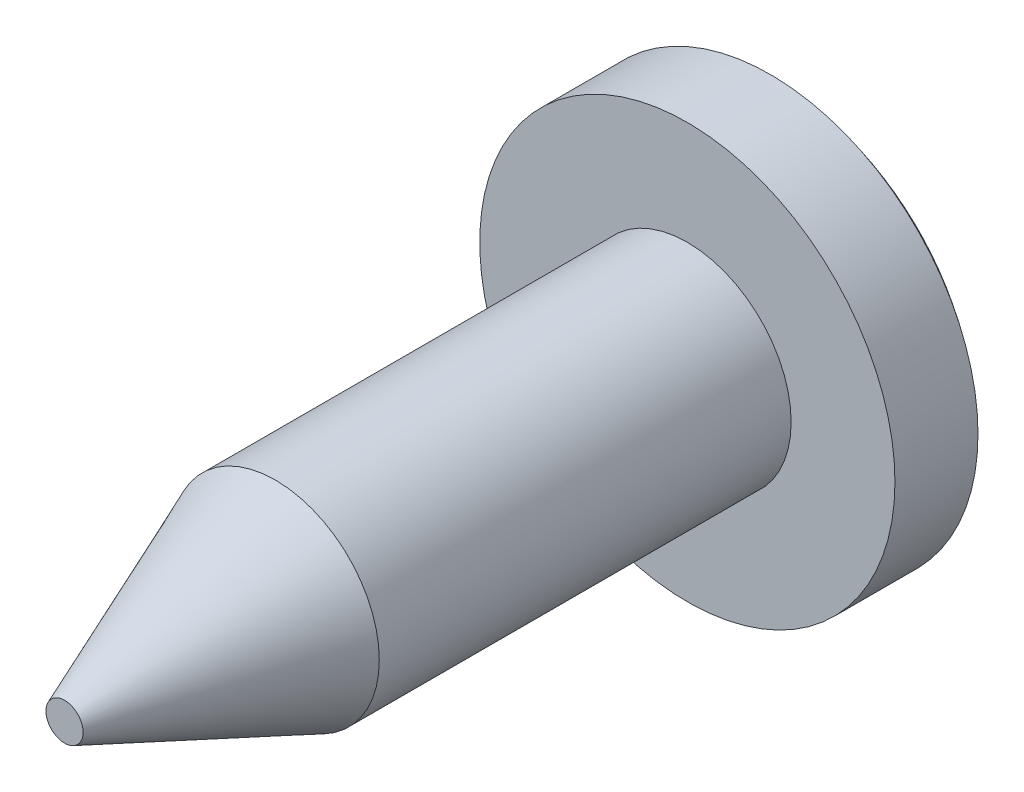
ISO-10303-21;
HEADER;
FILE_DESCRIPTION(('STEP AP214'),'2;1');
FILE_NAME('part.step','',(''),(''),'','','');
FILE_SCHEMA(('AUTOMOTIVE_DESIGN { 1 0 10303 214 1 1 1 1 }'));
ENDSEC;
DATA;
#1=APPLICATION_CONTEXT('core data for automotive mechanical design processes');
#2=APPLICATION_PROTOCOL_DEFINITION('international standard','automotive_design',2000,#1);
#3=PRODUCT_CONTEXT('',#1,'mechanical');
#4=PRODUCT('Part','Part','',(#3));
#5=PRODUCT_RELATED_PRODUCT_CATEGORY('part','',(#4));
#6=PRODUCT_DEFINITION_FORMATION('','',#4);
#7=PRODUCT_DEFINITION_CONTEXT('part definition',#1,'design');
#8=PRODUCT_DEFINITION('design','',#6,#7);
#9=PRODUCT_DEFINITION_SHAPE('','',#8);
#10=(LENGTH_UNIT() NAMED_UNIT(*) SI_UNIT(.MILLI.,.METRE.));
#11=(NAMED_UNIT(*) PLANE_ANGLE_UNIT() SI_UNIT($,.RADIAN.));
#12=(NAMED_UNIT(*) SI_UNIT($,.STERADIAN.) SOLID_ANGLE_UNIT());
#13=UNCERTAINTY_MEASURE_WITH_UNIT(LENGTH_MEASURE(1.E-05),#10,'distance_accuracy_value','');
#14=(GEOMETRIC_REPRESENTATION_CONTEXT(3) GLOBAL_UNCERTAINTY_ASSIGNED_CONTEXT((#13)) GLOBAL_UNIT_ASSIGNED_CONTEXT((#10,
#11,#12)) REPRESENTATION_CONTEXT('',''));
#15=CARTESIAN_POINT('',(0.,0.,0.));
#16=DIRECTION('',(0.,0.,1.));
#17=DIRECTION('',(1.,0.,0.));
#18=AXIS2_PLACEMENT_3D('',#15,#16,#17);
#19=CARTESIAN_POINT('',(0.3,-1.27,-6.8));
#20=DIRECTION('',(1.,0.,0.));
#21=DIRECTION('',(0.,0.,-1.));
#22=AXIS2_PLACEMENT_3D('',#19,#20,#21);
#23=PLANE('',#22);
#24=CARTESIAN_POINT('',(0.3,0.,-4.29285714285715));
#25=DIRECTION('',(1.,0.,0.));
#26=DIRECTION('',(0.,0.,-1.));
#27=AXIS2_PLACEMENT_3D('',#24,#25,#26);
#28=CIRCLE('',#27,3.19308084866675);
#29=CARTESIAN_POINT('',(0.3,1.27,-7.22250990489609));
#30=VERTEX_POINT('',#29);
#31=CARTESIAN_POINT('',(0.3,0.294469512293891,-7.47233084340128));
#32=VERTEX_POINT('',#31);
#33=EDGE_CURVE('E209',#30,#32,#28,.F.);
#34=ORIENTED_EDGE('',*,*,#33,.T.);
#35=DIRECTION('',(0.,0.,1.));
#36=VECTOR('',#35,1.);
#37=CARTESIAN_POINT('',(0.3,0.294469512293891,-6.8));
#38=LINE('',#37,#36);
#39=CARTESIAN_POINT('',(0.3,0.294469512293891,-6.8));
#40=VERTEX_POINT('',#39);
#41=EDGE_CURVE('E166',#32,#40,#38,.T.);
#42=ORIENTED_EDGE('',*,*,#41,.T.);
#43=DIRECTION('',(0.,1.,0.));
#44=VECTOR('',#43,1.);
#45=CARTESIAN_POINT('',(0.3,-1.27,-6.8));
#46=LINE('',#45,#44);
#47=CARTESIAN_POINT('',(0.3,1.27,-6.8));
#48=VERTEX_POINT('',#47);
#49=EDGE_CURVE('E192',#40,#48,#46,.T.);
#50=ORIENTED_EDGE('',*,*,#49,.T.);
#51=DIRECTION('',(0.,0.,-1.));
#52=VECTOR('',#51,1.);
#53=CARTESIAN_POINT('',(0.3,1.27,-6.8));
#54=LINE('',#53,#52);
#55=EDGE_CURVE('E180',#48,#30,#54,.T.);
#56=ORIENTED_EDGE('',*,*,#55,.T.);
#57=EDGE_LOOP('',(#34,#42,#50,#56));
#58=FACE_BOUND('',#57,.T.);
#59=ADVANCED_FACE('F36',(#58),#23,.F.);
#60=CARTESIAN_POINT('',(-0.3,-1.27,-6.8));
#61=DIRECTION('',(-1.,0.,0.));
#62=DIRECTION('',(0.,0.,1.));
#63=AXIS2_PLACEMENT_3D('',#60,#61,#62);
#64=PLANE('',#63);
#65=DIRECTION('',(0.,1.,0.));
#66=VECTOR('',#65,1.);
#67=CARTESIAN_POINT('',(-0.3,-1.27,-6.8));
#68=LINE('',#67,#66);
#69=CARTESIAN_POINT('',(-0.3,0.294469512293891,-6.8));
#70=VERTEX_POINT('',#69);
#71=CARTESIAN_POINT('',(-0.3,1.27,-6.8));
#72=VERTEX_POINT('',#71);
#73=EDGE_CURVE('E179',#70,#72,#68,.T.);
#74=ORIENTED_EDGE('',*,*,#73,.F.);
#75=DIRECTION('',(0.,0.,-1.));
#76=VECTOR('',#75,1.);
#77=CARTESIAN_POINT('',(-0.3,0.294469512293891,-6.8));
#78=LINE('',#77,#76);
#79=CARTESIAN_POINT('',(-0.3,0.294469512293891,-7.47233084340128));
#80=VERTEX_POINT('',#79);
#81=EDGE_CURVE('E217',#70,#80,#78,.T.);
#82=ORIENTED_EDGE('',*,*,#81,.T.);
#83=CARTESIAN_POINT('',(-0.3,0.,-4.29285714285715));
#84=DIRECTION('',(-1.,0.,0.));
#85=DIRECTION('',(0.,0.,1.));
#86=AXIS2_PLACEMENT_3D('',#83,#84,#85);
#87=CIRCLE('',#86,3.19308084866675);
#88=CARTESIAN_POINT('',(-0.3,1.27,-7.22250990489609));
#89=VERTEX_POINT('',#88);
#90=EDGE_CURVE('E204',#80,#89,#87,.F.);
#91=ORIENTED_EDGE('',*,*,#90,.T.);
#92=DIRECTION('',(0.,0.,1.));
#93=VECTOR('',#92,1.);
#94=CARTESIAN_POINT('',(-0.3,1.27,-6.8));
#95=LINE('',#94,#93);
#96=EDGE_CURVE('E183',#89,#72,#95,.T.);
#97=ORIENTED_EDGE('',*,*,#96,.T.);
#98=EDGE_LOOP('',(#74,#82,#91,#97));
#99=FACE_BOUND('',#98,.T.);
#100=ADVANCED_FACE('F239',(#99),#64,.F.);
#101=CARTESIAN_POINT('',(0.,0.,-4.29285714285715));
#102=DIRECTION('',(0.,0.,1.));
#103=DIRECTION('',(1.,0.,0.));
#104=AXIS2_PLACEMENT_3D('',#101,#102,#103);
#105=SPHERICAL_SURFACE('',#104,3.20714285714285);
#106=CARTESIAN_POINT('',(0.,0.294469512293891,-4.29285714285715));
#107=DIRECTION('',(0.,1.,0.));
#108=DIRECTION('',(0.,0.,1.));
#109=AXIS2_PLACEMENT_3D('',#106,#107,#108);
#110=CIRCLE('',#109,3.19359562444148);
#111=CARTESIAN_POINT('',(-1.27,0.294469512293891,-7.22307095970598));
#112=VERTEX_POINT('',#111);
#113=EDGE_CURVE('E164',#112,#80,#110,.F.);
#114=ORIENTED_EDGE('',*,*,#113,.F.);
#115=CARTESIAN_POINT('',(-1.27,0.,-4.29285714285715));
#116=DIRECTION('',(1.,0.,0.));
#117=DIRECTION('',(0.,0.,-1.));
#118=AXIS2_PLACEMENT_3D('',#115,#116,#117);
#119=CIRCLE('',#118,2.94497288716253);
#120=CARTESIAN_POINT('',(-1.27,-0.294469512293891,-7.22307095970598));
#121=VERTEX_POINT('',#120);
#122=EDGE_CURVE('E222',#112,#121,#119,.F.);
#123=ORIENTED_EDGE('',*,*,#122,.T.);
#124=CARTESIAN_POINT('',(0.,-0.294469512293891,-4.29285714285715));
#125=DIRECTION('',(0.,-1.,0.));
#126=DIRECTION('',(0.,0.,-1.));
#127=AXIS2_PLACEMENT_3D('',#124,#125,#126);
#128=CIRCLE('',#127,3.19359562444148);
#129=CARTESIAN_POINT('',(-0.3,-0.294469512293891,-7.47233084340128));
#130=VERTEX_POINT('',#129);
#131=EDGE_CURVE('E140',#130,#121,#128,.F.);
#132=ORIENTED_EDGE('',*,*,#131,.F.);
#133=CARTESIAN_POINT('',(-0.3,-1.27,-7.22250990489609));
#134=VERTEX_POINT('',#133);
#135=EDGE_CURVE('E205',#134,#130,#87,.F.);
#136=ORIENTED_EDGE('',*,*,#135,.F.);
#137=CARTESIAN_POINT('',(0.,-1.27,-4.29285714285715));
#138=DIRECTION('',(0.,1.,0.));
#139=DIRECTION('',(0.,0.,1.));
#140=AXIS2_PLACEMENT_3D('',#137,#138,#139);
#141=CIRCLE('',#140,2.94497288716253);
#142=CARTESIAN_POINT('',(0.3,-1.27,-7.22250990489609));
#143=VERTEX_POINT('',#142);
#144=EDGE_CURVE('E212',#134,#143,#141,.F.);
#145=ORIENTED_EDGE('',*,*,#144,.T.);
#146=CARTESIAN_POINT('',(0.3,-0.294469512293891,-7.47233084340128));
#147=VERTEX_POINT('',#146);
#148=EDGE_CURVE('E208',#147,#143,#28,.F.);
#149=ORIENTED_EDGE('',*,*,#148,.F.);
#150=CARTESIAN_POINT('',(1.27,-0.294469512293891,-7.22307095970598));
#151=VERTEX_POINT('',#150);
#152=EDGE_CURVE('E51',#151,#147,#128,.F.);
#153=ORIENTED_EDGE('',*,*,#152,.F.);
#154=CARTESIAN_POINT('',(1.27,0.,-4.29285714285715));
#155=DIRECTION('',(1.,0.,0.));
#156=DIRECTION('',(0.,0.,-1.));
#157=AXIS2_PLACEMENT_3D('',#154,#155,#156);
#158=CIRCLE('',#157,2.94497288716253);
#159=CARTESIAN_POINT('',(1.27,0.294469512293891,-7.22307095970598));
#160=VERTEX_POINT('',#159);
#161=EDGE_CURVE('E220',#160,#151,#158,.F.);
#162=ORIENTED_EDGE('',*,*,#161,.F.);
#163=EDGE_CURVE('E167',#32,#160,#110,.F.);
#164=ORIENTED_EDGE('',*,*,#163,.F.);
#165=ORIENTED_EDGE('',*,*,#33,.F.);
#166=CARTESIAN_POINT('',(0.,1.27,-4.29285714285715));
#167=DIRECTION('',(0.,1.,0.));
#168=DIRECTION('',(0.,0.,1.));
#169=AXIS2_PLACEMENT_3D('',#166,#167,#168);
#170=CIRCLE('',#169,2.94497288716253);
#171=EDGE_CURVE('E202',#89,#30,#170,.F.);
#172=ORIENTED_EDGE('',*,*,#171,.F.);
#173=ORIENTED_EDGE('',*,*,#90,.F.);
#174=EDGE_LOOP('',(#114,#123,#132,#136,#145,#149,#153,#162,#164,#165,#172,#173));
#175=FACE_BOUND('',#174,.T.);
#176=CARTESIAN_POINT('',(0.,0.,-6.8));
#177=DIRECTION('',(0.,0.,1.));
#178=DIRECTION('',(1.,0.,0.));
#179=AXIS2_PLACEMENT_3D('',#176,#177,#178);
#180=CIRCLE('',#179,2.);
#181=CARTESIAN_POINT('',(2.,0.,-6.8));
#182=VERTEX_POINT('',#181);
#183=EDGE_CURVE('E191',#182,#182,#180,.T.);
#184=ORIENTED_EDGE('',*,*,#183,.F.);
#185=EDGE_LOOP('',(#184));
#186=FACE_BOUND('',#185,.T.);
#187=ADVANCED_FACE('F246',(#175,#186),#105,.T.);
#188=CARTESIAN_POINT('',(0.,0.,0.));
#189=DIRECTION('',(0.,0.,1.));
#190=DIRECTION('',(1.,0.,0.));
#191=AXIS2_PLACEMENT_3D('',#188,#189,#190);
#192=PLANE('',#191);
#193=CARTESIAN_POINT('',(0.,0.,0.));
#194=DIRECTION('',(0.,0.,1.));
#195=DIRECTION('',(1.,0.,0.));
#196=AXIS2_PLACEMENT_3D('',#193,#194,#195);
#197=CIRCLE('',#196,0.17901870910296);
#198=CARTESIAN_POINT('',(0.17901870910296,0.,0.));
#199=VERTEX_POINT('',#198);
#200=EDGE_CURVE('E44',#199,#199,#197,.T.);
#201=ORIENTED_EDGE('',*,*,#200,.T.);
#202=EDGE_LOOP('',(#201));
#203=FACE_BOUND('',#202,.T.);
#204=ADVANCED_FACE('F226',(#203),#192,.T.);
#205=CARTESIAN_POINT('',(0.,0.,0.));
#206=DIRECTION('',(0.,0.,1.));
#207=DIRECTION('',(1.,0.,0.));
#208=AXIS2_PLACEMENT_3D('',#205,#206,#207);
#209=CYLINDRICAL_SURFACE('',#208,1.);
#210=CARTESIAN_POINT('',(0.,0.,-2.03200000000002));
#211=DIRECTION('',(0.,0.,1.));
#212=DIRECTION('',(1.,0.,0.));
#213=AXIS2_PLACEMENT_3D('',#210,#211,#212);
#214=CIRCLE('',#213,1.);
#215=CARTESIAN_POINT('',(1.,0.,-2.03200000000002));
#216=VERTEX_POINT('',#215);
#217=EDGE_CURVE('E11',#216,#216,#214,.F.);
#218=ORIENTED_EDGE('',*,*,#217,.T.);
#219=EDGE_LOOP('',(#218));
#220=FACE_BOUND('',#219,.T.);
#221=CARTESIAN_POINT('',(0.,0.,-6.));
#222=DIRECTION('',(0.,0.,1.));
#223=DIRECTION('',(1.,0.,0.));
#224=AXIS2_PLACEMENT_3D('',#221,#222,#223);
#225=CIRCLE('',#224,1.);
#226=CARTESIAN_POINT('',(1.,0.,-6.));
#227=VERTEX_POINT('',#226);
#228=EDGE_CURVE('E199',#227,#227,#225,.T.);
#229=ORIENTED_EDGE('',*,*,#228,.T.);
#230=EDGE_LOOP('',(#229));
#231=FACE_BOUND('',#230,.T.);
#232=ADVANCED_FACE('F394',(#220,#231),#209,.T.);
#233=CARTESIAN_POINT('',(1.,0.,-6.));
#234=DIRECTION('',(0.,0.,1.));
#235=DIRECTION('',(1.,0.,0.));
#236=AXIS2_PLACEMENT_3D('',#233,#234,#235);
#237=PLANE('',#236);
#238=CARTESIAN_POINT('',(0.,0.,-6.));
#239=DIRECTION('',(0.,0.,1.));
#240=DIRECTION('',(1.,0.,0.));
#241=AXIS2_PLACEMENT_3D('',#238,#239,#240);
#242=CIRCLE('',#241,2.);
#243=CARTESIAN_POINT('',(2.,0.,-6.));
#244=VERTEX_POINT('',#243);
#245=EDGE_CURVE('E196',#244,#244,#242,.T.);
#246=ORIENTED_EDGE('',*,*,#245,.T.);
#247=EDGE_LOOP('',(#246));
#248=FACE_BOUND('',#247,.T.);
#249=ORIENTED_EDGE('',*,*,#228,.F.);
#250=EDGE_LOOP('',(#249));
#251=FACE_BOUND('',#250,.T.);
#252=ADVANCED_FACE('F259',(#248,#251),#237,.T.);
#253=CARTESIAN_POINT('',(0.,0.,0.));
#254=DIRECTION('',(0.,0.,1.));
#255=DIRECTION('',(1.,0.,0.));
#256=AXIS2_PLACEMENT_3D('',#253,#254,#255);
#257=CYLINDRICAL_SURFACE('',#256,2.);
#258=ORIENTED_EDGE('',*,*,#183,.T.);
#259=EDGE_LOOP('',(#258));
#260=FACE_BOUND('',#259,.T.);
#261=ORIENTED_EDGE('',*,*,#245,.F.);
#262=EDGE_LOOP('',(#261));
#263=FACE_BOUND('',#262,.T.);
#264=ADVANCED_FACE('F252',(#260,#263),#257,.T.);
#265=CARTESIAN_POINT('',(0.3,-1.27,-6.8));
#266=VERTEX_POINT('',#265);
#267=CARTESIAN_POINT('',(0.3,-0.294469512293891,-6.8));
#268=VERTEX_POINT('',#267);
#269=EDGE_CURVE('E188',#266,#268,#46,.T.);
#270=ORIENTED_EDGE('',*,*,#269,.T.);
#271=DIRECTION('',(0.,0.,-1.));
#272=VECTOR('',#271,1.);
#273=CARTESIAN_POINT('',(0.3,-0.294469512293891,-6.8));
#274=LINE('',#273,#272);
#275=EDGE_CURVE('E162',#268,#147,#274,.T.);
#276=ORIENTED_EDGE('',*,*,#275,.T.);
#277=ORIENTED_EDGE('',*,*,#148,.T.);
#278=DIRECTION('',(0.,0.,-1.));
#279=VECTOR('',#278,1.);
#280=CARTESIAN_POINT('',(0.3,-1.27,-6.8));
#281=LINE('',#280,#279);
#282=EDGE_CURVE('E170',#266,#143,#281,.T.);
#283=ORIENTED_EDGE('',*,*,#282,.F.);
#284=EDGE_LOOP('',(#270,#276,#277,#283));
#285=FACE_BOUND('',#284,.T.);
#286=ADVANCED_FACE('F242',(#285),#23,.F.);
#287=CARTESIAN_POINT('',(0.3,-1.27,-6.8));
#288=DIRECTION('',(0.,0.,1.));
#289=DIRECTION('',(1.,0.,0.));
#290=AXIS2_PLACEMENT_3D('',#287,#288,#289);
#291=PLANE('',#290);
#292=CARTESIAN_POINT('',(-0.3,-1.27,-6.8));
#293=VERTEX_POINT('',#292);
#294=CARTESIAN_POINT('',(-0.3,-0.294469512293891,-6.8));
#295=VERTEX_POINT('',#294);
#296=EDGE_CURVE('E132',#293,#295,#68,.T.);
#297=ORIENTED_EDGE('',*,*,#296,.T.);
#298=DIRECTION('',(1.,0.,0.));
#299=VECTOR('',#298,1.);
#300=CARTESIAN_POINT('',(-1.27,-0.294469512293891,-6.8));
#301=LINE('',#300,#299);
#302=CARTESIAN_POINT('',(-1.27,-0.294469512293891,-6.8));
#303=VERTEX_POINT('',#302);
#304=EDGE_CURVE('E59',#303,#295,#301,.T.);
#305=ORIENTED_EDGE('',*,*,#304,.F.);
#306=DIRECTION('',(0.,-1.,0.));
#307=VECTOR('',#306,1.);
#308=CARTESIAN_POINT('',(-1.27,0.294469512293891,-6.8));
#309=LINE('',#308,#307);
#310=CARTESIAN_POINT('',(-1.27,0.294469512293891,-6.8));
#311=VERTEX_POINT('',#310);
#312=EDGE_CURVE('E129',#311,#303,#309,.T.);
#313=ORIENTED_EDGE('',*,*,#312,.F.);
#314=DIRECTION('',(1.,0.,0.));
#315=VECTOR('',#314,1.);
#316=CARTESIAN_POINT('',(-1.27,0.294469512293891,-6.8));
#317=LINE('',#316,#315);
#318=EDGE_CURVE('E159',#311,#70,#317,.T.);
#319=ORIENTED_EDGE('',*,*,#318,.T.);
#320=ORIENTED_EDGE('',*,*,#73,.T.);
#321=DIRECTION('',(1.,0.,0.));
#322=VECTOR('',#321,1.);
#323=CARTESIAN_POINT('',(0.3,1.27,-6.8));
#324=LINE('',#323,#322);
#325=EDGE_CURVE('E174',#72,#48,#324,.T.);
#326=ORIENTED_EDGE('',*,*,#325,.T.);
#327=ORIENTED_EDGE('',*,*,#49,.F.);
#328=CARTESIAN_POINT('',(1.27,0.294469512293891,-6.8));
#329=VERTEX_POINT('',#328);
#330=EDGE_CURVE('E133',#40,#329,#317,.T.);
#331=ORIENTED_EDGE('',*,*,#330,.T.);
#332=DIRECTION('',(0.,-1.,0.));
#333=VECTOR('',#332,1.);
#334=CARTESIAN_POINT('',(1.27,0.294469512293891,-6.8));
#335=LINE('',#334,#333);
#336=CARTESIAN_POINT('',(1.27,-0.294469512293891,-6.8));
#337=VERTEX_POINT('',#336);
#338=EDGE_CURVE('E155',#329,#337,#335,.T.);
#339=ORIENTED_EDGE('',*,*,#338,.T.);
#340=EDGE_CURVE('E134',#268,#337,#301,.T.);
#341=ORIENTED_EDGE('',*,*,#340,.F.);
#342=ORIENTED_EDGE('',*,*,#269,.F.);
#343=DIRECTION('',(1.,0.,0.));
#344=VECTOR('',#343,1.);
#345=CARTESIAN_POINT('',(0.3,-1.27,-6.8));
#346=LINE('',#345,#344);
#347=EDGE_CURVE('E176',#293,#266,#346,.T.);
#348=ORIENTED_EDGE('',*,*,#347,.F.);
#349=EDGE_LOOP('',(#297,#305,#313,#319,#320,#326,#327,#331,#339,#341,#342,#348));
#350=FACE_BOUND('',#349,.T.);
#351=ADVANCED_FACE('F126',(#350),#291,.F.);
#352=ORIENTED_EDGE('',*,*,#135,.T.);
#353=DIRECTION('',(0.,0.,1.));
#354=VECTOR('',#353,1.);
#355=CARTESIAN_POINT('',(-0.3,-0.294469512293891,-6.8));
#356=LINE('',#355,#354);
#357=EDGE_CURVE('E215',#130,#295,#356,.T.);
#358=ORIENTED_EDGE('',*,*,#357,.T.);
#359=ORIENTED_EDGE('',*,*,#296,.F.);
#360=DIRECTION('',(0.,0.,1.));
#361=VECTOR('',#360,1.);
#362=CARTESIAN_POINT('',(-0.3,-1.27,-6.8));
#363=LINE('',#362,#361);
#364=EDGE_CURVE('E173',#134,#293,#363,.T.);
#365=ORIENTED_EDGE('',*,*,#364,.F.);
#366=EDGE_LOOP('',(#352,#358,#359,#365));
#367=FACE_BOUND('',#366,.T.);
#368=ADVANCED_FACE('F249',(#367),#64,.F.);
#369=CARTESIAN_POINT('',(0.3,-1.27,-8.31845680738049));
#370=DIRECTION('',(0.,1.,0.));
#371=DIRECTION('',(0.,0.,1.));
#372=AXIS2_PLACEMENT_3D('',#369,#370,#371);
#373=PLANE('',#372);
#374=ORIENTED_EDGE('',*,*,#364,.T.);
#375=ORIENTED_EDGE('',*,*,#347,.T.);
#376=ORIENTED_EDGE('',*,*,#282,.T.);
#377=ORIENTED_EDGE('',*,*,#144,.F.);
#378=EDGE_LOOP('',(#374,#375,#376,#377));
#379=FACE_BOUND('',#378,.T.);
#380=ADVANCED_FACE('F276',(#379),#373,.T.);
#381=CARTESIAN_POINT('',(0.3,1.27,-8.31845680738049));
#382=DIRECTION('',(0.,1.,0.));
#383=DIRECTION('',(0.,0.,1.));
#384=AXIS2_PLACEMENT_3D('',#381,#382,#383);
#385=PLANE('',#384);
#386=ORIENTED_EDGE('',*,*,#171,.T.);
#387=ORIENTED_EDGE('',*,*,#55,.F.);
#388=ORIENTED_EDGE('',*,*,#325,.F.);
#389=ORIENTED_EDGE('',*,*,#96,.F.);
#390=EDGE_LOOP('',(#386,#387,#388,#389));
#391=FACE_BOUND('',#390,.T.);
#392=ADVANCED_FACE('F288',(#391),#385,.F.);
#393=CARTESIAN_POINT('',(-1.27,0.294469512293891,-6.8));
#394=DIRECTION('',(0.,1.,0.));
#395=DIRECTION('',(0.,0.,1.));
#396=AXIS2_PLACEMENT_3D('',#393,#394,#395);
#397=PLANE('',#396);
#398=ORIENTED_EDGE('',*,*,#113,.T.);
#399=ORIENTED_EDGE('',*,*,#81,.F.);
#400=ORIENTED_EDGE('',*,*,#318,.F.);
#401=DIRECTION('',(0.,0.,1.));
#402=VECTOR('',#401,1.);
#403=CARTESIAN_POINT('',(-1.27,0.294469512293891,-6.8));
#404=LINE('',#403,#402);
#405=EDGE_CURVE('E143',#112,#311,#404,.T.);
#406=ORIENTED_EDGE('',*,*,#405,.F.);
#407=EDGE_LOOP('',(#398,#399,#400,#406));
#408=FACE_BOUND('',#407,.T.);
#409=ADVANCED_FACE('F281',(#408),#397,.F.);
#410=CARTESIAN_POINT('',(-1.27,-0.294469512293891,-6.8));
#411=DIRECTION('',(0.,-1.,0.));
#412=DIRECTION('',(0.,0.,-1.));
#413=AXIS2_PLACEMENT_3D('',#410,#411,#412);
#414=PLANE('',#413);
#415=ORIENTED_EDGE('',*,*,#131,.T.);
#416=DIRECTION('',(0.,0.,-1.));
#417=VECTOR('',#416,1.);
#418=CARTESIAN_POINT('',(-1.27,-0.294469512293891,-6.8));
#419=LINE('',#418,#417);
#420=EDGE_CURVE('E137',#303,#121,#419,.T.);
#421=ORIENTED_EDGE('',*,*,#420,.F.);
#422=ORIENTED_EDGE('',*,*,#304,.T.);
#423=ORIENTED_EDGE('',*,*,#357,.F.);
#424=EDGE_LOOP('',(#415,#421,#422,#423));
#425=FACE_BOUND('',#424,.T.);
#426=ADVANCED_FACE('F138',(#425),#414,.F.);
#427=CARTESIAN_POINT('',(-1.27,-0.294469512293891,-6.8));
#428=DIRECTION('',(1.,0.,0.));
#429=DIRECTION('',(0.,0.,-1.));
#430=AXIS2_PLACEMENT_3D('',#427,#428,#429);
#431=PLANE('',#430);
#432=ORIENTED_EDGE('',*,*,#405,.T.);
#433=ORIENTED_EDGE('',*,*,#312,.T.);
#434=ORIENTED_EDGE('',*,*,#420,.T.);
#435=ORIENTED_EDGE('',*,*,#122,.F.);
#436=EDGE_LOOP('',(#432,#433,#434,#435));
#437=FACE_BOUND('',#436,.T.);
#438=ADVANCED_FACE('F145',(#437),#431,.T.);
#439=ORIENTED_EDGE('',*,*,#163,.T.);
#440=DIRECTION('',(0.,0.,1.));
#441=VECTOR('',#440,1.);
#442=CARTESIAN_POINT('',(1.27,0.294469512293891,-6.8));
#443=LINE('',#442,#441);
#444=EDGE_CURVE('E148',#160,#329,#443,.T.);
#445=ORIENTED_EDGE('',*,*,#444,.T.);
#446=ORIENTED_EDGE('',*,*,#330,.F.);
#447=ORIENTED_EDGE('',*,*,#41,.F.);
#448=EDGE_LOOP('',(#439,#445,#446,#447));
#449=FACE_BOUND('',#448,.T.);
#450=ADVANCED_FACE('F291',(#449),#397,.F.);
#451=ORIENTED_EDGE('',*,*,#152,.T.);
#452=ORIENTED_EDGE('',*,*,#275,.F.);
#453=ORIENTED_EDGE('',*,*,#340,.T.);
#454=DIRECTION('',(0.,0.,-1.));
#455=VECTOR('',#454,1.);
#456=CARTESIAN_POINT('',(1.27,-0.294469512293891,-6.8));
#457=LINE('',#456,#455);
#458=EDGE_CURVE('E151',#337,#151,#457,.T.);
#459=ORIENTED_EDGE('',*,*,#458,.T.);
#460=EDGE_LOOP('',(#451,#452,#453,#459));
#461=FACE_BOUND('',#460,.T.);
#462=ADVANCED_FACE('F234',(#461),#414,.F.);
#463=CARTESIAN_POINT('',(1.27,-0.294469512293891,-6.8));
#464=DIRECTION('',(1.,0.,0.));
#465=DIRECTION('',(0.,0.,-1.));
#466=AXIS2_PLACEMENT_3D('',#463,#464,#465);
#467=PLANE('',#466);
#468=ORIENTED_EDGE('',*,*,#161,.T.);
#469=ORIENTED_EDGE('',*,*,#458,.F.);
#470=ORIENTED_EDGE('',*,*,#338,.F.);
#471=ORIENTED_EDGE('',*,*,#444,.F.);
#472=EDGE_LOOP('',(#468,#469,#470,#471));
#473=FACE_BOUND('',#472,.T.);
#474=ADVANCED_FACE('F229',(#473),#467,.F.);
#475=CARTESIAN_POINT('',(0.,0.,0.));
#476=DIRECTION('',(0.,0.,-1.));
#477=DIRECTION('',(-1.,0.,0.));
#478=AXIS2_PLACEMENT_3D('',#475,#476,#477);
#479=CONICAL_SURFACE('',#478,0.17901870910296,0.38397243543875);
#480=ORIENTED_EDGE('',*,*,#217,.F.);
#481=EDGE_LOOP('',(#480));
#482=FACE_BOUND('',#481,.T.);
#483=ORIENTED_EDGE('',*,*,#200,.F.);
#484=EDGE_LOOP('',(#483));
#485=FACE_BOUND('',#484,.T.);
#486=ADVANCED_FACE('F38',(#482,#485),#479,.T.);
#487=CLOSED_SHELL('',(#59,#100,#187,#204,#232,#252,#264,#286,#351,#368,#380,#392,#409,#426,#438,
#450,#462,#474,#486));
#488=MANIFOLD_SOLID_BREP('B2',#487);
#489=ADVANCED_BREP_SHAPE_REPRESENTATION('',(#18,#488),#14);
#490=SHAPE_DEFINITION_REPRESENTATION(#9,#489);
ENDSEC;
END-ISO-10303-21;
